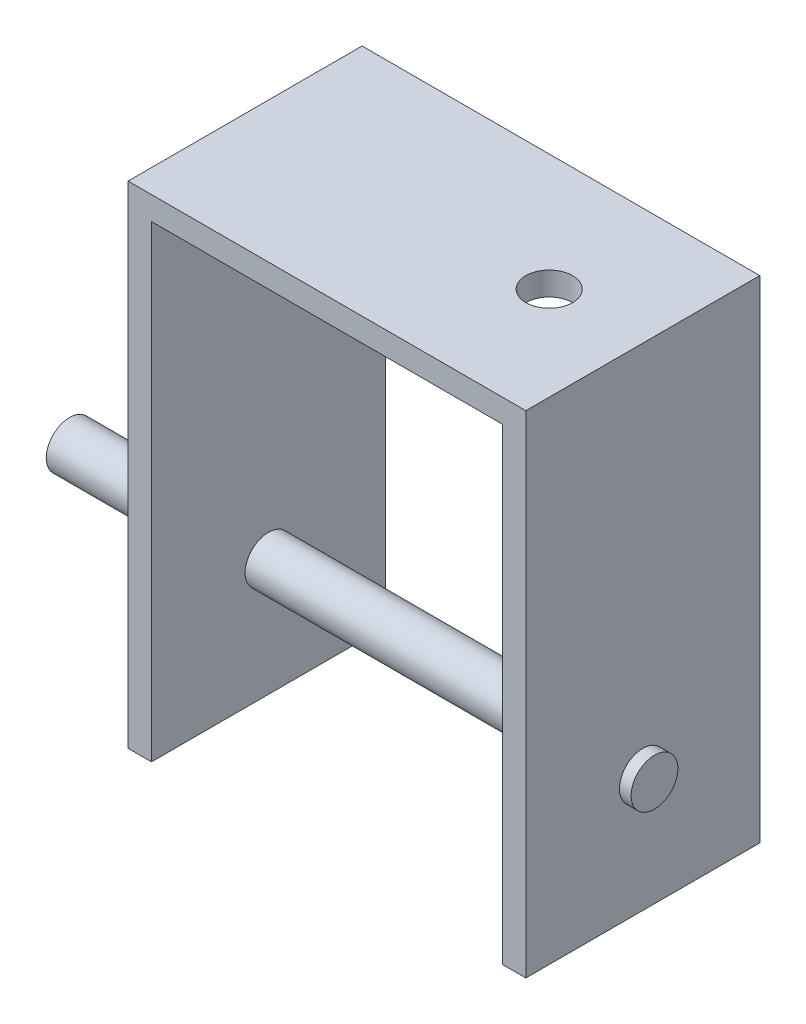
ISO-10303-21;
HEADER;
FILE_DESCRIPTION(('STEP AP214'),'2;1');
FILE_NAME('part.step','',(''),(''),'','','');
FILE_SCHEMA(('AUTOMOTIVE_DESIGN { 1 0 10303 214 1 1 1 1 }'));
ENDSEC;
DATA;
#1=APPLICATION_CONTEXT('core data for automotive mechanical design processes');
#2=APPLICATION_PROTOCOL_DEFINITION('international standard','automotive_design',2000,#1);
#3=PRODUCT_CONTEXT('',#1,'mechanical');
#4=PRODUCT('Part','Part','',(#3));
#5=PRODUCT_RELATED_PRODUCT_CATEGORY('part','',(#4));
#6=PRODUCT_DEFINITION_FORMATION('','',#4);
#7=PRODUCT_DEFINITION_CONTEXT('part definition',#1,'design');
#8=PRODUCT_DEFINITION('design','',#6,#7);
#9=PRODUCT_DEFINITION_SHAPE('','',#8);
#10=(LENGTH_UNIT() NAMED_UNIT(*) SI_UNIT(.MILLI.,.METRE.));
#11=(NAMED_UNIT(*) PLANE_ANGLE_UNIT() SI_UNIT($,.RADIAN.));
#12=(NAMED_UNIT(*) SI_UNIT($,.STERADIAN.) SOLID_ANGLE_UNIT());
#13=UNCERTAINTY_MEASURE_WITH_UNIT(LENGTH_MEASURE(1.E-05),#10,'distance_accuracy_value','');
#14=(GEOMETRIC_REPRESENTATION_CONTEXT(3) GLOBAL_UNCERTAINTY_ASSIGNED_CONTEXT((#13)) GLOBAL_UNIT_ASSIGNED_CONTEXT((#10,
#11,#12)) REPRESENTATION_CONTEXT('',''));
#15=CARTESIAN_POINT('',(0.,0.,0.));
#16=DIRECTION('',(0.,0.,1.));
#17=DIRECTION('',(1.,0.,0.));
#18=AXIS2_PLACEMENT_3D('',#15,#16,#17);
#19=CARTESIAN_POINT('',(-38.9636651003149,28.8453586159442,20.));
#20=DIRECTION('',(1.,0.,0.));
#21=DIRECTION('',(0.,1.,0.));
#22=AXIS2_PLACEMENT_3D('',#19,#20,#21);
#23=PLANE('',#22);
#24=CARTESIAN_POINT('',(-38.9636651003148,-1.15464138405578,10.));
#25=DIRECTION('',(1.,0.,0.));
#26=DIRECTION('',(0.,1.,0.));
#27=AXIS2_PLACEMENT_3D('',#24,#25,#26);
#28=CIRCLE('',#27,2.);
#29=CARTESIAN_POINT('',(-38.9636651003148,0.845358615944218,10.));
#30=VERTEX_POINT('',#29);
#31=EDGE_CURVE('E146',#30,#30,#28,.T.);
#32=ORIENTED_EDGE('',*,*,#31,.T.);
#33=EDGE_LOOP('',(#32));
#34=FACE_BOUND('',#33,.T.);
#35=DIRECTION('',(0.,-1.,0.));
#36=VECTOR('',#35,1.);
#37=CARTESIAN_POINT('',(-38.9636651003149,28.8453586159442,0.));
#38=LINE('',#37,#36);
#39=CARTESIAN_POINT('',(-38.9636651003149,30.8453586159442,0.));
#40=VERTEX_POINT('',#39);
#41=CARTESIAN_POINT('',(-38.9636651003148,-11.1546413840558,0.));
#42=VERTEX_POINT('',#41);
#43=EDGE_CURVE('E100',#40,#42,#38,.T.);
#44=ORIENTED_EDGE('',*,*,#43,.T.);
#45=DIRECTION('',(0.,0.,-1.));
#46=VECTOR('',#45,1.);
#47=CARTESIAN_POINT('',(-38.9636651003148,-11.1546413840558,20.));
#48=LINE('',#47,#46);
#49=CARTESIAN_POINT('',(-38.9636651003148,-11.1546413840558,20.));
#50=VERTEX_POINT('',#49);
#51=EDGE_CURVE('E13',#50,#42,#48,.T.);
#52=ORIENTED_EDGE('',*,*,#51,.F.);
#53=DIRECTION('',(0.,-1.,0.));
#54=VECTOR('',#53,1.);
#55=CARTESIAN_POINT('',(-38.9636651003149,30.8453586159442,20.));
#56=LINE('',#55,#54);
#57=CARTESIAN_POINT('',(-38.9636651003149,30.8453586159442,20.));
#58=VERTEX_POINT('',#57);
#59=EDGE_CURVE('E106',#58,#50,#56,.T.);
#60=ORIENTED_EDGE('',*,*,#59,.F.);
#61=DIRECTION('',(0.,0.,-1.));
#62=VECTOR('',#61,1.);
#63=CARTESIAN_POINT('',(-38.9636651003149,30.8453586159442,20.));
#64=LINE('',#63,#62);
#65=EDGE_CURVE('E140',#58,#40,#64,.T.);
#66=ORIENTED_EDGE('',*,*,#65,.T.);
#67=EDGE_LOOP('',(#44,#52,#60,#66));
#68=FACE_BOUND('',#67,.T.);
#69=ADVANCED_FACE('F47',(#34,#68),#23,.F.);
#70=CARTESIAN_POINT('',(-38.9636651003148,-11.1546413840558,20.));
#71=DIRECTION('',(0.,1.,0.));
#72=DIRECTION('',(0.,0.,1.));
#73=AXIS2_PLACEMENT_3D('',#70,#71,#72);
#74=PLANE('',#73);
#75=DIRECTION('',(1.,0.,0.));
#76=VECTOR('',#75,1.);
#77=CARTESIAN_POINT('',(-38.9636651003148,-11.1546413840558,0.));
#78=LINE('',#77,#76);
#79=CARTESIAN_POINT('',(-36.9636651003148,-11.1546413840558,0.));
#80=VERTEX_POINT('',#79);
#81=EDGE_CURVE('E145',#42,#80,#78,.T.);
#82=ORIENTED_EDGE('',*,*,#81,.T.);
#83=DIRECTION('',(0.,0.,-1.));
#84=VECTOR('',#83,1.);
#85=CARTESIAN_POINT('',(-36.9636651003148,-11.1546413840558,20.));
#86=LINE('',#85,#84);
#87=CARTESIAN_POINT('',(-36.9636651003148,-11.1546413840558,20.));
#88=VERTEX_POINT('',#87);
#89=EDGE_CURVE('E56',#88,#80,#86,.T.);
#90=ORIENTED_EDGE('',*,*,#89,.F.);
#91=DIRECTION('',(1.,0.,0.));
#92=VECTOR('',#91,1.);
#93=CARTESIAN_POINT('',(-38.9636651003148,-11.1546413840558,20.));
#94=LINE('',#93,#92);
#95=EDGE_CURVE('E191',#50,#88,#94,.T.);
#96=ORIENTED_EDGE('',*,*,#95,.F.);
#97=ORIENTED_EDGE('',*,*,#51,.T.);
#98=EDGE_LOOP('',(#82,#90,#96,#97));
#99=FACE_BOUND('',#98,.T.);
#100=ADVANCED_FACE('F228',(#99),#74,.F.);
#101=CARTESIAN_POINT('',(-36.9636651003148,-11.1546413840558,20.));
#102=DIRECTION('',(-1.,0.,0.));
#103=DIRECTION('',(0.,0.,1.));
#104=AXIS2_PLACEMENT_3D('',#101,#102,#103);
#105=PLANE('',#104);
#106=CARTESIAN_POINT('',(-36.9636651003148,-1.15464138405578,10.));
#107=DIRECTION('',(-1.,0.,0.));
#108=DIRECTION('',(0.,0.,1.));
#109=AXIS2_PLACEMENT_3D('',#106,#107,#108);
#110=CIRCLE('',#109,2.);
#111=CARTESIAN_POINT('',(-36.9636651003148,-1.15464138405578,12.));
#112=VERTEX_POINT('',#111);
#113=EDGE_CURVE('E196',#112,#112,#110,.T.);
#114=ORIENTED_EDGE('',*,*,#113,.T.);
#115=EDGE_LOOP('',(#114));
#116=FACE_BOUND('',#115,.T.);
#117=DIRECTION('',(0.,1.,0.));
#118=VECTOR('',#117,1.);
#119=CARTESIAN_POINT('',(-36.9636651003148,-11.1546413840558,0.));
#120=LINE('',#119,#118);
#121=CARTESIAN_POINT('',(-36.9636651003148,28.8453586159442,0.));
#122=VERTEX_POINT('',#121);
#123=EDGE_CURVE('E148',#80,#122,#120,.T.);
#124=ORIENTED_EDGE('',*,*,#123,.T.);
#125=DIRECTION('',(0.,0.,-1.));
#126=VECTOR('',#125,1.);
#127=CARTESIAN_POINT('',(-36.9636651003148,28.8453586159442,20.));
#128=LINE('',#127,#126);
#129=CARTESIAN_POINT('',(-36.9636651003148,28.8453586159442,20.));
#130=VERTEX_POINT('',#129);
#131=EDGE_CURVE('E165',#130,#122,#128,.T.);
#132=ORIENTED_EDGE('',*,*,#131,.F.);
#133=DIRECTION('',(0.,1.,0.));
#134=VECTOR('',#133,1.);
#135=CARTESIAN_POINT('',(-36.9636651003148,-11.1546413840558,20.));
#136=LINE('',#135,#134);
#137=EDGE_CURVE('E175',#88,#130,#136,.T.);
#138=ORIENTED_EDGE('',*,*,#137,.F.);
#139=ORIENTED_EDGE('',*,*,#89,.T.);
#140=EDGE_LOOP('',(#124,#132,#138,#139));
#141=FACE_BOUND('',#140,.T.);
#142=ADVANCED_FACE('F173',(#116,#141),#105,.F.);
#143=CARTESIAN_POINT('',(-36.9636651003148,28.8453586159442,20.));
#144=DIRECTION('',(0.,1.,0.));
#145=DIRECTION('',(0.,0.,1.));
#146=AXIS2_PLACEMENT_3D('',#143,#144,#145);
#147=PLANE('',#146);
#148=CARTESIAN_POINT('',(-12.9636651003149,28.8453586159442,10.));
#149=DIRECTION('',(0.,1.,0.));
#150=DIRECTION('',(0.,0.,1.));
#151=AXIS2_PLACEMENT_3D('',#148,#149,#150);
#152=CIRCLE('',#151,2.);
#153=CARTESIAN_POINT('',(-12.9636651003149,28.8453586159442,12.));
#154=VERTEX_POINT('',#153);
#155=EDGE_CURVE('E208',#154,#154,#152,.T.);
#156=ORIENTED_EDGE('',*,*,#155,.T.);
#157=EDGE_LOOP('',(#156));
#158=FACE_BOUND('',#157,.T.);
#159=DIRECTION('',(1.,0.,0.));
#160=VECTOR('',#159,1.);
#161=CARTESIAN_POINT('',(-36.9636651003148,28.8453586159442,0.));
#162=LINE('',#161,#160);
#163=CARTESIAN_POINT('',(-6.96366510031485,28.8453586159442,0.));
#164=VERTEX_POINT('',#163);
#165=EDGE_CURVE('E150',#122,#164,#162,.T.);
#166=ORIENTED_EDGE('',*,*,#165,.T.);
#167=DIRECTION('',(0.,0.,-1.));
#168=VECTOR('',#167,1.);
#169=CARTESIAN_POINT('',(-6.96366510031485,28.8453586159442,20.));
#170=LINE('',#169,#168);
#171=CARTESIAN_POINT('',(-6.96366510031485,28.8453586159442,20.));
#172=VERTEX_POINT('',#171);
#173=EDGE_CURVE('E162',#172,#164,#170,.T.);
#174=ORIENTED_EDGE('',*,*,#173,.F.);
#175=DIRECTION('',(1.,0.,0.));
#176=VECTOR('',#175,1.);
#177=CARTESIAN_POINT('',(-36.9636651003148,28.8453586159442,20.));
#178=LINE('',#177,#176);
#179=EDGE_CURVE('E187',#130,#172,#178,.T.);
#180=ORIENTED_EDGE('',*,*,#179,.F.);
#181=ORIENTED_EDGE('',*,*,#131,.T.);
#182=EDGE_LOOP('',(#166,#174,#180,#181));
#183=FACE_BOUND('',#182,.T.);
#184=ADVANCED_FACE('F183',(#158,#183),#147,.F.);
#185=CARTESIAN_POINT('',(-6.96366510031485,28.8453586159442,20.));
#186=DIRECTION('',(1.,0.,0.));
#187=DIRECTION('',(0.,1.,0.));
#188=AXIS2_PLACEMENT_3D('',#185,#186,#187);
#189=PLANE('',#188);
#190=CARTESIAN_POINT('',(-6.96366510031484,-1.15464138405578,10.));
#191=DIRECTION('',(1.,0.,0.));
#192=DIRECTION('',(0.,1.,0.));
#193=AXIS2_PLACEMENT_3D('',#190,#191,#192);
#194=CIRCLE('',#193,2.);
#195=CARTESIAN_POINT('',(-6.96366510031484,0.845358615944218,10.));
#196=VERTEX_POINT('',#195);
#197=EDGE_CURVE('E199',#196,#196,#194,.T.);
#198=ORIENTED_EDGE('',*,*,#197,.T.);
#199=EDGE_LOOP('',(#198));
#200=FACE_BOUND('',#199,.T.);
#201=DIRECTION('',(0.,-1.,0.));
#202=VECTOR('',#201,1.);
#203=CARTESIAN_POINT('',(-6.96366510031485,28.8453586159442,0.));
#204=LINE('',#203,#202);
#205=CARTESIAN_POINT('',(-6.96366510031484,-11.1546413840558,0.));
#206=VERTEX_POINT('',#205);
#207=EDGE_CURVE('E152',#164,#206,#204,.T.);
#208=ORIENTED_EDGE('',*,*,#207,.T.);
#209=DIRECTION('',(0.,0.,-1.));
#210=VECTOR('',#209,1.);
#211=CARTESIAN_POINT('',(-6.96366510031484,-11.1546413840558,20.));
#212=LINE('',#211,#210);
#213=CARTESIAN_POINT('',(-6.96366510031484,-11.1546413840558,20.));
#214=VERTEX_POINT('',#213);
#215=EDGE_CURVE('E135',#214,#206,#212,.T.);
#216=ORIENTED_EDGE('',*,*,#215,.F.);
#217=DIRECTION('',(0.,-1.,0.));
#218=VECTOR('',#217,1.);
#219=CARTESIAN_POINT('',(-6.96366510031485,28.8453586159442,20.));
#220=LINE('',#219,#218);
#221=EDGE_CURVE('E126',#172,#214,#220,.T.);
#222=ORIENTED_EDGE('',*,*,#221,.F.);
#223=ORIENTED_EDGE('',*,*,#173,.T.);
#224=EDGE_LOOP('',(#208,#216,#222,#223));
#225=FACE_BOUND('',#224,.T.);
#226=ADVANCED_FACE('F186',(#200,#225),#189,.F.);
#227=CARTESIAN_POINT('',(-6.96366510031484,-11.1546413840558,20.));
#228=DIRECTION('',(0.,1.,0.));
#229=DIRECTION('',(0.,0.,1.));
#230=AXIS2_PLACEMENT_3D('',#227,#228,#229);
#231=PLANE('',#230);
#232=DIRECTION('',(1.,0.,0.));
#233=VECTOR('',#232,1.);
#234=CARTESIAN_POINT('',(-6.96366510031484,-11.1546413840558,0.));
#235=LINE('',#234,#233);
#236=CARTESIAN_POINT('',(-4.96366510031484,-11.1546413840558,0.));
#237=VERTEX_POINT('',#236);
#238=EDGE_CURVE('E134',#206,#237,#235,.T.);
#239=ORIENTED_EDGE('',*,*,#238,.T.);
#240=DIRECTION('',(0.,0.,-1.));
#241=VECTOR('',#240,1.);
#242=CARTESIAN_POINT('',(-4.96366510031484,-11.1546413840558,20.));
#243=LINE('',#242,#241);
#244=CARTESIAN_POINT('',(-4.96366510031484,-11.1546413840558,20.));
#245=VERTEX_POINT('',#244);
#246=EDGE_CURVE('E131',#245,#237,#243,.T.);
#247=ORIENTED_EDGE('',*,*,#246,.F.);
#248=DIRECTION('',(1.,0.,0.));
#249=VECTOR('',#248,1.);
#250=CARTESIAN_POINT('',(-6.96366510031484,-11.1546413840558,20.));
#251=LINE('',#250,#249);
#252=EDGE_CURVE('E120',#214,#245,#251,.T.);
#253=ORIENTED_EDGE('',*,*,#252,.F.);
#254=ORIENTED_EDGE('',*,*,#215,.T.);
#255=EDGE_LOOP('',(#239,#247,#253,#254));
#256=FACE_BOUND('',#255,.T.);
#257=ADVANCED_FACE('F132',(#256),#231,.F.);
#258=CARTESIAN_POINT('',(-4.96366510031484,-11.1546413840558,20.));
#259=DIRECTION('',(-1.,0.,0.));
#260=DIRECTION('',(0.,-1.,0.));
#261=AXIS2_PLACEMENT_3D('',#258,#259,#260);
#262=PLANE('',#261);
#263=CARTESIAN_POINT('',(-4.96366510031484,-1.15464138405578,10.));
#264=DIRECTION('',(-1.,0.,0.));
#265=DIRECTION('',(0.,-1.,0.));
#266=AXIS2_PLACEMENT_3D('',#263,#264,#265);
#267=CIRCLE('',#266,2.);
#268=CARTESIAN_POINT('',(-4.96366510031484,-3.15464138405578,10.));
#269=VERTEX_POINT('',#268);
#270=EDGE_CURVE('E50',#269,#269,#267,.T.);
#271=ORIENTED_EDGE('',*,*,#270,.T.);
#272=EDGE_LOOP('',(#271));
#273=FACE_BOUND('',#272,.T.);
#274=DIRECTION('',(0.,1.,0.));
#275=VECTOR('',#274,1.);
#276=CARTESIAN_POINT('',(-4.96366510031484,-11.1546413840558,0.));
#277=LINE('',#276,#275);
#278=CARTESIAN_POINT('',(-4.96366510031484,30.8453586159442,0.));
#279=VERTEX_POINT('',#278);
#280=EDGE_CURVE('E93',#237,#279,#277,.T.);
#281=ORIENTED_EDGE('',*,*,#280,.T.);
#282=DIRECTION('',(0.,0.,-1.));
#283=VECTOR('',#282,1.);
#284=CARTESIAN_POINT('',(-4.96366510031484,30.8453586159442,20.));
#285=LINE('',#284,#283);
#286=CARTESIAN_POINT('',(-4.96366510031484,30.8453586159442,20.));
#287=VERTEX_POINT('',#286);
#288=EDGE_CURVE('E136',#287,#279,#285,.T.);
#289=ORIENTED_EDGE('',*,*,#288,.F.);
#290=DIRECTION('',(0.,1.,0.));
#291=VECTOR('',#290,1.);
#292=CARTESIAN_POINT('',(-4.96366510031484,-11.1546413840558,20.));
#293=LINE('',#292,#291);
#294=EDGE_CURVE('E124',#245,#287,#293,.T.);
#295=ORIENTED_EDGE('',*,*,#294,.F.);
#296=ORIENTED_EDGE('',*,*,#246,.T.);
#297=EDGE_LOOP('',(#281,#289,#295,#296));
#298=FACE_BOUND('',#297,.T.);
#299=ADVANCED_FACE('F138',(#273,#298),#262,.F.);
#300=CARTESIAN_POINT('',(-4.96366510031484,30.8453586159442,20.));
#301=DIRECTION('',(0.,-1.,0.));
#302=DIRECTION('',(1.,0.,0.));
#303=AXIS2_PLACEMENT_3D('',#300,#301,#302);
#304=PLANE('',#303);
#305=CARTESIAN_POINT('',(-12.9636651003149,30.8453586159442,10.));
#306=DIRECTION('',(0.,1.,0.));
#307=DIRECTION('',(0.,0.,1.));
#308=AXIS2_PLACEMENT_3D('',#305,#306,#307);
#309=CIRCLE('',#308,2.);
#310=CARTESIAN_POINT('',(-12.9636651003149,30.8453586159442,12.));
#311=VERTEX_POINT('',#310);
#312=EDGE_CURVE('E209',#311,#311,#309,.T.);
#313=ORIENTED_EDGE('',*,*,#312,.F.);
#314=EDGE_LOOP('',(#313));
#315=FACE_BOUND('',#314,.T.);
#316=DIRECTION('',(-1.,0.,0.));
#317=VECTOR('',#316,1.);
#318=CARTESIAN_POINT('',(-4.96366510031484,30.8453586159442,0.));
#319=LINE('',#318,#317);
#320=EDGE_CURVE('E156',#279,#40,#319,.T.);
#321=ORIENTED_EDGE('',*,*,#320,.T.);
#322=ORIENTED_EDGE('',*,*,#65,.F.);
#323=DIRECTION('',(-1.,0.,0.));
#324=VECTOR('',#323,1.);
#325=CARTESIAN_POINT('',(-4.96366510031484,30.8453586159442,20.));
#326=LINE('',#325,#324);
#327=EDGE_CURVE('E64',#287,#58,#326,.T.);
#328=ORIENTED_EDGE('',*,*,#327,.F.);
#329=ORIENTED_EDGE('',*,*,#288,.T.);
#330=EDGE_LOOP('',(#321,#322,#328,#329));
#331=FACE_BOUND('',#330,.T.);
#332=ADVANCED_FACE('F223',(#315,#331),#304,.F.);
#333=CARTESIAN_POINT('',(0.,0.,20.));
#334=DIRECTION('',(0.,0.,1.));
#335=DIRECTION('',(1.,0.,0.));
#336=AXIS2_PLACEMENT_3D('',#333,#334,#335);
#337=PLANE('',#336);
#338=ORIENTED_EDGE('',*,*,#59,.T.);
#339=ORIENTED_EDGE('',*,*,#95,.T.);
#340=ORIENTED_EDGE('',*,*,#137,.T.);
#341=ORIENTED_EDGE('',*,*,#179,.T.);
#342=ORIENTED_EDGE('',*,*,#221,.T.);
#343=ORIENTED_EDGE('',*,*,#252,.T.);
#344=ORIENTED_EDGE('',*,*,#294,.T.);
#345=ORIENTED_EDGE('',*,*,#327,.T.);
#346=EDGE_LOOP('',(#338,#339,#340,#341,#342,#343,#344,#345));
#347=FACE_BOUND('',#346,.T.);
#348=ADVANCED_FACE('F122',(#347),#337,.T.);
#349=CARTESIAN_POINT('',(0.,0.,0.));
#350=DIRECTION('',(0.,0.,1.));
#351=DIRECTION('',(1.,0.,0.));
#352=AXIS2_PLACEMENT_3D('',#349,#350,#351);
#353=PLANE('',#352);
#354=ORIENTED_EDGE('',*,*,#43,.F.);
#355=ORIENTED_EDGE('',*,*,#320,.F.);
#356=ORIENTED_EDGE('',*,*,#280,.F.);
#357=ORIENTED_EDGE('',*,*,#238,.F.);
#358=ORIENTED_EDGE('',*,*,#207,.F.);
#359=ORIENTED_EDGE('',*,*,#165,.F.);
#360=ORIENTED_EDGE('',*,*,#123,.F.);
#361=ORIENTED_EDGE('',*,*,#81,.F.);
#362=EDGE_LOOP('',(#354,#355,#356,#357,#358,#359,#360,#361));
#363=FACE_BOUND('',#362,.T.);
#364=ADVANCED_FACE('F179',(#363),#353,.F.);
#365=CARTESIAN_POINT('',(-3.96366510031485,-1.15464138405578,10.));
#366=DIRECTION('',(-1.,0.,0.));
#367=DIRECTION('',(0.,0.,1.));
#368=AXIS2_PLACEMENT_3D('',#365,#366,#367);
#369=PLANE('',#368);
#370=CARTESIAN_POINT('',(-3.96366510031485,-1.15464138405578,10.));
#371=DIRECTION('',(-1.,0.,0.));
#372=DIRECTION('',(0.,0.,1.));
#373=AXIS2_PLACEMENT_3D('',#370,#371,#372);
#374=CIRCLE('',#373,2.);
#375=CARTESIAN_POINT('',(-3.96366510031485,-1.15464138405578,12.));
#376=VERTEX_POINT('',#375);
#377=EDGE_CURVE('E202',#376,#376,#374,.T.);
#378=ORIENTED_EDGE('',*,*,#377,.F.);
#379=EDGE_LOOP('',(#378));
#380=FACE_BOUND('',#379,.T.);
#381=ADVANCED_FACE('F250',(#380),#369,.F.);
#382=CARTESIAN_POINT('',(-3.96366510031485,-1.15464138405578,10.));
#383=DIRECTION('',(-1.,0.,0.));
#384=DIRECTION('',(0.,0.,1.));
#385=AXIS2_PLACEMENT_3D('',#382,#383,#384);
#386=CYLINDRICAL_SURFACE('',#385,2.);
#387=ORIENTED_EDGE('',*,*,#377,.T.);
#388=EDGE_LOOP('',(#387));
#389=FACE_BOUND('',#388,.T.);
#390=ORIENTED_EDGE('',*,*,#270,.F.);
#391=EDGE_LOOP('',(#390));
#392=FACE_BOUND('',#391,.T.);
#393=ADVANCED_FACE('F258',(#389,#392),#386,.T.);
#394=ORIENTED_EDGE('',*,*,#197,.F.);
#395=EDGE_LOOP('',(#394));
#396=FACE_BOUND('',#395,.T.);
#397=ORIENTED_EDGE('',*,*,#113,.F.);
#398=EDGE_LOOP('',(#397));
#399=FACE_BOUND('',#398,.T.);
#400=ADVANCED_FACE('F256',(#396,#399),#386,.T.);
#401=CARTESIAN_POINT('',(-53.9636651003148,-1.15464138405578,10.));
#402=DIRECTION('',(-1.,0.,0.));
#403=DIRECTION('',(0.,0.,1.));
#404=AXIS2_PLACEMENT_3D('',#401,#402,#403);
#405=CIRCLE('',#404,2.);
#406=CARTESIAN_POINT('',(-53.9636651003148,-1.15464138405578,12.));
#407=VERTEX_POINT('',#406);
#408=EDGE_CURVE('E205',#407,#407,#405,.T.);
#409=ORIENTED_EDGE('',*,*,#408,.F.);
#410=EDGE_LOOP('',(#409));
#411=FACE_BOUND('',#410,.T.);
#412=ORIENTED_EDGE('',*,*,#31,.F.);
#413=EDGE_LOOP('',(#412));
#414=FACE_BOUND('',#413,.T.);
#415=ADVANCED_FACE('F253',(#411,#414),#386,.T.);
#416=CARTESIAN_POINT('',(-53.9636651003148,-1.15464138405578,10.));
#417=DIRECTION('',(-1.,0.,0.));
#418=DIRECTION('',(0.,0.,1.));
#419=AXIS2_PLACEMENT_3D('',#416,#417,#418);
#420=PLANE('',#419);
#421=ORIENTED_EDGE('',*,*,#408,.T.);
#422=EDGE_LOOP('',(#421));
#423=FACE_BOUND('',#422,.T.);
#424=ADVANCED_FACE('F219',(#423),#420,.T.);
#425=CARTESIAN_POINT('',(-12.9636651003149,28.8453586159442,10.));
#426=DIRECTION('',(0.,1.,0.));
#427=DIRECTION('',(0.,0.,1.));
#428=AXIS2_PLACEMENT_3D('',#425,#426,#427);
#429=CYLINDRICAL_SURFACE('',#428,2.);
#430=ORIENTED_EDGE('',*,*,#155,.F.);
#431=EDGE_LOOP('',(#430));
#432=FACE_BOUND('',#431,.T.);
#433=ORIENTED_EDGE('',*,*,#312,.T.);
#434=EDGE_LOOP('',(#433));
#435=FACE_BOUND('',#434,.T.);
#436=ADVANCED_FACE('F216',(#432,#435),#429,.F.);
#437=CLOSED_SHELL('',(#69,#100,#142,#184,#226,#257,#299,#332,#348,#364,#381,#393,#400,#415,#424,#436));
#438=MANIFOLD_SOLID_BREP('B2',#437);
#439=ADVANCED_BREP_SHAPE_REPRESENTATION('',(#18,#438),#14);
#440=SHAPE_DEFINITION_REPRESENTATION(#9,#439);
ENDSEC;
END-ISO-10303-21;
